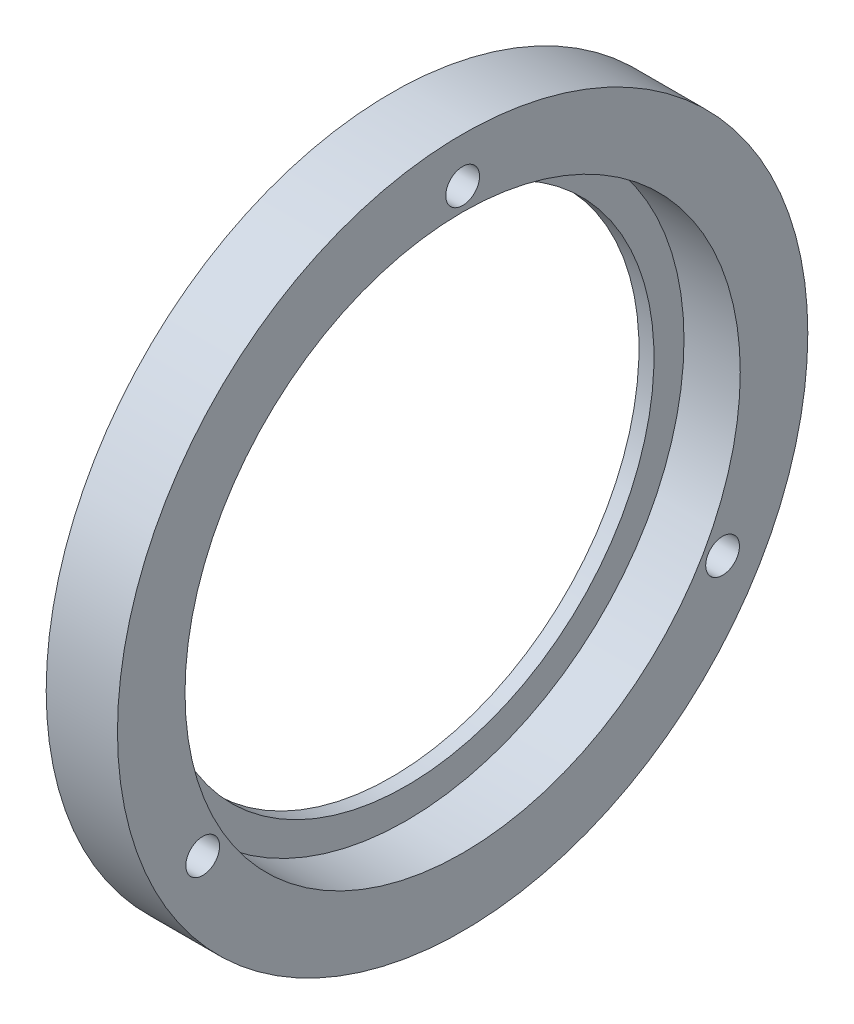
ISO-10303-21;
HEADER;
FILE_DESCRIPTION(('STEP AP214'),'2;1');
FILE_NAME('part.step','',(''),(''),'','','');
FILE_SCHEMA(('AUTOMOTIVE_DESIGN { 1 0 10303 214 1 1 1 1 }'));
ENDSEC;
DATA;
#1=APPLICATION_CONTEXT('core data for automotive mechanical design processes');
#2=APPLICATION_PROTOCOL_DEFINITION('international standard','automotive_design',2000,#1);
#3=PRODUCT_CONTEXT('',#1,'mechanical');
#4=PRODUCT('Part','Part','',(#3));
#5=PRODUCT_RELATED_PRODUCT_CATEGORY('part','',(#4));
#6=PRODUCT_DEFINITION_FORMATION('','',#4);
#7=PRODUCT_DEFINITION_CONTEXT('part definition',#1,'design');
#8=PRODUCT_DEFINITION('design','',#6,#7);
#9=PRODUCT_DEFINITION_SHAPE('','',#8);
#10=(LENGTH_UNIT() NAMED_UNIT(*) SI_UNIT(.MILLI.,.METRE.));
#11=(NAMED_UNIT(*) PLANE_ANGLE_UNIT() SI_UNIT($,.RADIAN.));
#12=(NAMED_UNIT(*) SI_UNIT($,.STERADIAN.) SOLID_ANGLE_UNIT());
#13=UNCERTAINTY_MEASURE_WITH_UNIT(LENGTH_MEASURE(1.E-05),#10,'distance_accuracy_value','');
#14=(GEOMETRIC_REPRESENTATION_CONTEXT(3) GLOBAL_UNCERTAINTY_ASSIGNED_CONTEXT((#13)) GLOBAL_UNIT_ASSIGNED_CONTEXT((#10,
#11,#12)) REPRESENTATION_CONTEXT('',''));
#15=CARTESIAN_POINT('',(0.,0.,0.));
#16=DIRECTION('',(0.,0.,1.));
#17=DIRECTION('',(1.,0.,0.));
#18=AXIS2_PLACEMENT_3D('',#15,#16,#17);
#19=CARTESIAN_POINT('',(0.,0.,0.));
#20=DIRECTION('',(-1.,0.,0.));
#21=DIRECTION('',(0.,0.,1.));
#22=AXIS2_PLACEMENT_3D('',#19,#20,#21);
#23=CYLINDRICAL_SURFACE('',#22,33.);
#24=CARTESIAN_POINT('',(0.,0.,0.));
#25=DIRECTION('',(-1.,0.,0.));
#26=DIRECTION('',(0.,0.,1.));
#27=AXIS2_PLACEMENT_3D('',#24,#25,#26);
#28=CIRCLE('',#27,33.);
#29=CARTESIAN_POINT('',(0.,0.,33.));
#30=VERTEX_POINT('',#29);
#31=EDGE_CURVE('E10',#30,#30,#28,.T.);
#32=ORIENTED_EDGE('',*,*,#31,.T.);
#33=EDGE_LOOP('',(#32));
#34=FACE_BOUND('',#33,.T.);
#35=CARTESIAN_POINT('',(2.,0.,0.));
#36=DIRECTION('',(-1.,0.,0.));
#37=DIRECTION('',(0.,0.,1.));
#38=AXIS2_PLACEMENT_3D('',#35,#36,#37);
#39=CIRCLE('',#38,33.);
#40=CARTESIAN_POINT('',(2.,0.,33.));
#41=VERTEX_POINT('',#40);
#42=EDGE_CURVE('E52',#41,#41,#39,.T.);
#43=ORIENTED_EDGE('',*,*,#42,.F.);
#44=EDGE_LOOP('',(#43));
#45=FACE_BOUND('',#44,.T.);
#46=ADVANCED_FACE('F30',(#34,#45),#23,.F.);
#47=CARTESIAN_POINT('',(-1.2490009027033E-13,33.,0.));
#48=DIRECTION('',(-1.,0.,0.));
#49=DIRECTION('',(0.,0.,1.));
#50=AXIS2_PLACEMENT_3D('',#47,#48,#49);
#51=PLANE('',#50);
#52=CARTESIAN_POINT('',(0.,-19.9999999999997,-34.6410161513777));
#53=DIRECTION('',(-1.,0.,0.));
#54=DIRECTION('',(0.,0.866025403784443,-0.499999999999992));
#55=AXIS2_PLACEMENT_3D('',#52,#53,#54);
#56=CIRCLE('',#55,2.25);
#57=CARTESIAN_POINT('',(0.,-18.0514428414847,-35.7660161513777));
#58=VERTEX_POINT('',#57);
#59=EDGE_CURVE('E70',#58,#58,#56,.T.);
#60=ORIENTED_EDGE('',*,*,#59,.F.);
#61=EDGE_LOOP('',(#60));
#62=FACE_BOUND('',#61,.T.);
#63=CARTESIAN_POINT('',(0.,-20.0000000000002,34.6410161513774));
#64=DIRECTION('',(-1.,0.,0.));
#65=DIRECTION('',(0.,-0.866025403784436,-0.500000000000004));
#66=AXIS2_PLACEMENT_3D('',#63,#64,#65);
#67=CIRCLE('',#66,2.25);
#68=CARTESIAN_POINT('',(0.,-21.9485571585151,33.5160161513774));
#69=VERTEX_POINT('',#68);
#70=EDGE_CURVE('E64',#69,#69,#67,.T.);
#71=ORIENTED_EDGE('',*,*,#70,.F.);
#72=EDGE_LOOP('',(#71));
#73=FACE_BOUND('',#72,.T.);
#74=CARTESIAN_POINT('',(0.,40.,0.));
#75=DIRECTION('',(-1.,0.,0.));
#76=DIRECTION('',(0.,0.,1.));
#77=AXIS2_PLACEMENT_3D('',#74,#75,#76);
#78=CIRCLE('',#77,2.25);
#79=CARTESIAN_POINT('',(0.,40.,2.25));
#80=VERTEX_POINT('',#79);
#81=EDGE_CURVE('E58',#80,#80,#78,.T.);
#82=ORIENTED_EDGE('',*,*,#81,.F.);
#83=EDGE_LOOP('',(#82));
#84=FACE_BOUND('',#83,.T.);
#85=CARTESIAN_POINT('',(0.,0.,0.));
#86=DIRECTION('',(-1.,0.,0.));
#87=DIRECTION('',(0.,0.,1.));
#88=AXIS2_PLACEMENT_3D('',#85,#86,#87);
#89=CIRCLE('',#88,46.);
#90=CARTESIAN_POINT('',(0.,0.,46.));
#91=VERTEX_POINT('',#90);
#92=EDGE_CURVE('E36',#91,#91,#89,.T.);
#93=ORIENTED_EDGE('',*,*,#92,.T.);
#94=EDGE_LOOP('',(#93));
#95=FACE_BOUND('',#94,.T.);
#96=ORIENTED_EDGE('',*,*,#31,.F.);
#97=EDGE_LOOP('',(#96));
#98=FACE_BOUND('',#97,.T.);
#99=ADVANCED_FACE('F76',(#62,#73,#84,#95,#98),#51,.T.);
#100=CARTESIAN_POINT('',(0.,0.,0.));
#101=DIRECTION('',(-1.,0.,0.));
#102=DIRECTION('',(0.,0.,1.));
#103=AXIS2_PLACEMENT_3D('',#100,#101,#102);
#104=CYLINDRICAL_SURFACE('',#103,46.);
#105=CARTESIAN_POINT('',(9.49999999999999,0.,0.));
#106=DIRECTION('',(-1.,0.,0.));
#107=DIRECTION('',(0.,0.,1.));
#108=AXIS2_PLACEMENT_3D('',#105,#106,#107);
#109=CIRCLE('',#108,46.);
#110=CARTESIAN_POINT('',(9.49999999999999,0.,46.));
#111=VERTEX_POINT('',#110);
#112=EDGE_CURVE('E40',#111,#111,#109,.T.);
#113=ORIENTED_EDGE('',*,*,#112,.T.);
#114=EDGE_LOOP('',(#113));
#115=FACE_BOUND('',#114,.T.);
#116=ORIENTED_EDGE('',*,*,#92,.F.);
#117=EDGE_LOOP('',(#116));
#118=FACE_BOUND('',#117,.T.);
#119=ADVANCED_FACE('F79',(#115,#118),#104,.T.);
#120=CARTESIAN_POINT('',(9.49999999999994,46.,0.));
#121=DIRECTION('',(1.,0.,0.));
#122=DIRECTION('',(0.,0.,-1.));
#123=AXIS2_PLACEMENT_3D('',#120,#121,#122);
#124=PLANE('',#123);
#125=CARTESIAN_POINT('',(9.49999999999999,-19.9999999999997,-34.6410161513777));
#126=DIRECTION('',(-1.,0.,0.));
#127=DIRECTION('',(0.,0.866025403784443,-0.499999999999992));
#128=AXIS2_PLACEMENT_3D('',#125,#126,#127);
#129=CIRCLE('',#128,2.25);
#130=CARTESIAN_POINT('',(9.49999999999999,-18.0514428414847,-35.7660161513777));
#131=VERTEX_POINT('',#130);
#132=EDGE_CURVE('E67',#131,#131,#129,.T.);
#133=ORIENTED_EDGE('',*,*,#132,.T.);
#134=EDGE_LOOP('',(#133));
#135=FACE_BOUND('',#134,.T.);
#136=CARTESIAN_POINT('',(9.5,-20.0000000000002,34.6410161513774));
#137=DIRECTION('',(-1.,0.,0.));
#138=DIRECTION('',(0.,-0.866025403784436,-0.500000000000004));
#139=AXIS2_PLACEMENT_3D('',#136,#137,#138);
#140=CIRCLE('',#139,2.25);
#141=CARTESIAN_POINT('',(9.5,-21.9485571585151,33.5160161513774));
#142=VERTEX_POINT('',#141);
#143=EDGE_CURVE('E61',#142,#142,#140,.T.);
#144=ORIENTED_EDGE('',*,*,#143,.T.);
#145=EDGE_LOOP('',(#144));
#146=FACE_BOUND('',#145,.T.);
#147=CARTESIAN_POINT('',(9.5,40.,0.));
#148=DIRECTION('',(-1.,0.,0.));
#149=DIRECTION('',(0.,0.,1.));
#150=AXIS2_PLACEMENT_3D('',#147,#148,#149);
#151=CIRCLE('',#150,2.25);
#152=CARTESIAN_POINT('',(9.5,40.,2.25));
#153=VERTEX_POINT('',#152);
#154=EDGE_CURVE('E55',#153,#153,#151,.T.);
#155=ORIENTED_EDGE('',*,*,#154,.T.);
#156=EDGE_LOOP('',(#155));
#157=FACE_BOUND('',#156,.T.);
#158=CARTESIAN_POINT('',(9.49999999999999,0.,0.));
#159=DIRECTION('',(-1.,0.,0.));
#160=DIRECTION('',(0.,0.,1.));
#161=AXIS2_PLACEMENT_3D('',#158,#159,#160);
#162=CIRCLE('',#161,37.);
#163=CARTESIAN_POINT('',(9.49999999999999,0.,37.));
#164=VERTEX_POINT('',#163);
#165=EDGE_CURVE('E44',#164,#164,#162,.T.);
#166=ORIENTED_EDGE('',*,*,#165,.T.);
#167=EDGE_LOOP('',(#166));
#168=FACE_BOUND('',#167,.T.);
#169=ORIENTED_EDGE('',*,*,#112,.F.);
#170=EDGE_LOOP('',(#169));
#171=FACE_BOUND('',#170,.T.);
#172=ADVANCED_FACE('F111',(#135,#146,#157,#168,#171),#124,.T.);
#173=CARTESIAN_POINT('',(0.,0.,0.));
#174=DIRECTION('',(-1.,0.,0.));
#175=DIRECTION('',(0.,0.,1.));
#176=AXIS2_PLACEMENT_3D('',#173,#174,#175);
#177=CYLINDRICAL_SURFACE('',#176,37.);
#178=CARTESIAN_POINT('',(2.,0.,0.));
#179=DIRECTION('',(-1.,0.,0.));
#180=DIRECTION('',(0.,0.,1.));
#181=AXIS2_PLACEMENT_3D('',#178,#179,#180);
#182=CIRCLE('',#181,37.);
#183=CARTESIAN_POINT('',(2.,0.,37.));
#184=VERTEX_POINT('',#183);
#185=EDGE_CURVE('E49',#184,#184,#182,.T.);
#186=ORIENTED_EDGE('',*,*,#185,.T.);
#187=EDGE_LOOP('',(#186));
#188=FACE_BOUND('',#187,.T.);
#189=ORIENTED_EDGE('',*,*,#165,.F.);
#190=EDGE_LOOP('',(#189));
#191=FACE_BOUND('',#190,.T.);
#192=ADVANCED_FACE('F97',(#188,#191),#177,.F.);
#193=CARTESIAN_POINT('',(1.99999999999999,37.,0.));
#194=DIRECTION('',(1.,0.,0.));
#195=DIRECTION('',(0.,0.,-1.));
#196=AXIS2_PLACEMENT_3D('',#193,#194,#195);
#197=PLANE('',#196);
#198=ORIENTED_EDGE('',*,*,#42,.T.);
#199=EDGE_LOOP('',(#198));
#200=FACE_BOUND('',#199,.T.);
#201=ORIENTED_EDGE('',*,*,#185,.F.);
#202=EDGE_LOOP('',(#201));
#203=FACE_BOUND('',#202,.T.);
#204=ADVANCED_FACE('F88',(#200,#203),#197,.T.);
#205=CARTESIAN_POINT('',(9.5,40.,0.));
#206=DIRECTION('',(-1.,0.,0.));
#207=DIRECTION('',(0.,0.,1.));
#208=AXIS2_PLACEMENT_3D('',#205,#206,#207);
#209=CYLINDRICAL_SURFACE('',#208,2.25);
#210=ORIENTED_EDGE('',*,*,#154,.F.);
#211=EDGE_LOOP('',(#210));
#212=FACE_BOUND('',#211,.T.);
#213=ORIENTED_EDGE('',*,*,#81,.T.);
#214=EDGE_LOOP('',(#213));
#215=FACE_BOUND('',#214,.T.);
#216=ADVANCED_FACE('F85',(#212,#215),#209,.F.);
#217=CARTESIAN_POINT('',(9.5,-20.0000000000002,34.6410161513774));
#218=DIRECTION('',(-1.,0.,0.));
#219=DIRECTION('',(0.,0.,1.));
#220=AXIS2_PLACEMENT_3D('',#217,#218,#219);
#221=CYLINDRICAL_SURFACE('',#220,2.25);
#222=ORIENTED_EDGE('',*,*,#143,.F.);
#223=EDGE_LOOP('',(#222));
#224=FACE_BOUND('',#223,.T.);
#225=ORIENTED_EDGE('',*,*,#70,.T.);
#226=EDGE_LOOP('',(#225));
#227=FACE_BOUND('',#226,.T.);
#228=ADVANCED_FACE('F87',(#224,#227),#221,.F.);
#229=CARTESIAN_POINT('',(9.49999999999999,-19.9999999999997,-34.6410161513777));
#230=DIRECTION('',(-1.,0.,0.));
#231=DIRECTION('',(0.,0.,1.));
#232=AXIS2_PLACEMENT_3D('',#229,#230,#231);
#233=CYLINDRICAL_SURFACE('',#232,2.25);
#234=ORIENTED_EDGE('',*,*,#132,.F.);
#235=EDGE_LOOP('',(#234));
#236=FACE_BOUND('',#235,.T.);
#237=ORIENTED_EDGE('',*,*,#59,.T.);
#238=EDGE_LOOP('',(#237));
#239=FACE_BOUND('',#238,.T.);
#240=ADVANCED_FACE('F74',(#236,#239),#233,.F.);
#241=CLOSED_SHELL('',(#46,#99,#119,#172,#192,#204,#216,#228,#240));
#242=MANIFOLD_SOLID_BREP('B2',#241);
#243=ADVANCED_BREP_SHAPE_REPRESENTATION('',(#18,#242),#14);
#244=SHAPE_DEFINITION_REPRESENTATION(#9,#243);
ENDSEC;
END-ISO-10303-21;
